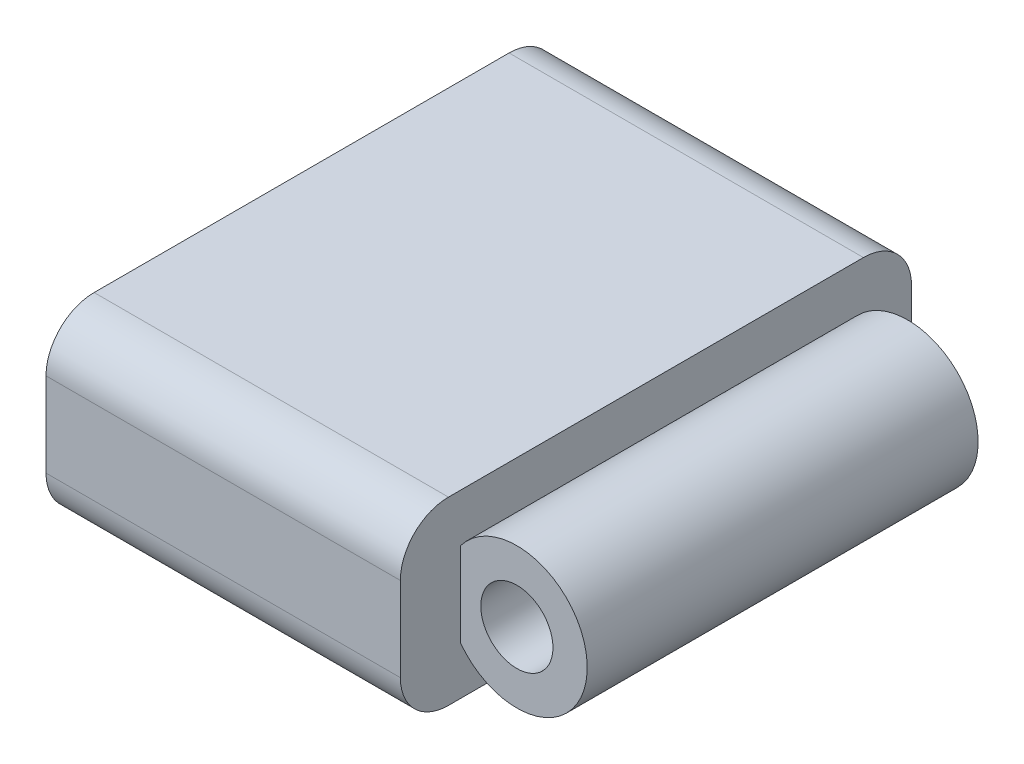
ISO-10303-21;
HEADER;
FILE_DESCRIPTION(('STEP AP214'),'2;1');
FILE_NAME('part.step','',(''),(''),'','','');
FILE_SCHEMA(('AUTOMOTIVE_DESIGN { 1 0 10303 214 1 1 1 1 }'));
ENDSEC;
DATA;
#1=APPLICATION_CONTEXT('core data for automotive mechanical design processes');
#2=APPLICATION_PROTOCOL_DEFINITION('international standard','automotive_design',2000,#1);
#3=PRODUCT_CONTEXT('',#1,'mechanical');
#4=PRODUCT('Part','Part','',(#3));
#5=PRODUCT_RELATED_PRODUCT_CATEGORY('part','',(#4));
#6=PRODUCT_DEFINITION_FORMATION('','',#4);
#7=PRODUCT_DEFINITION_CONTEXT('part definition',#1,'design');
#8=PRODUCT_DEFINITION('design','',#6,#7);
#9=PRODUCT_DEFINITION_SHAPE('','',#8);
#10=(LENGTH_UNIT() NAMED_UNIT(*) SI_UNIT(.MILLI.,.METRE.));
#11=(NAMED_UNIT(*) PLANE_ANGLE_UNIT() SI_UNIT($,.RADIAN.));
#12=(NAMED_UNIT(*) SI_UNIT($,.STERADIAN.) SOLID_ANGLE_UNIT());
#13=UNCERTAINTY_MEASURE_WITH_UNIT(LENGTH_MEASURE(1.E-05),#10,'distance_accuracy_value','');
#14=(GEOMETRIC_REPRESENTATION_CONTEXT(3) GLOBAL_UNCERTAINTY_ASSIGNED_CONTEXT((#13)) GLOBAL_UNIT_ASSIGNED_CONTEXT((#10,
#11,#12)) REPRESENTATION_CONTEXT('',''));
#15=CARTESIAN_POINT('',(0.,0.,0.));
#16=DIRECTION('',(0.,0.,1.));
#17=DIRECTION('',(1.,0.,0.));
#18=AXIS2_PLACEMENT_3D('',#15,#16,#17);
#19=CARTESIAN_POINT('',(0.,19.05,0.));
#20=DIRECTION('',(0.,0.,-1.));
#21=DIRECTION('',(-1.,0.,0.));
#22=AXIS2_PLACEMENT_3D('',#19,#20,#21);
#23=PLANE('',#22);
#24=DIRECTION('',(1.,0.,0.));
#25=VECTOR('',#24,1.);
#26=CARTESIAN_POINT('',(50.8,5.08,0.));
#27=LINE('',#26,#25);
#28=CARTESIAN_POINT('',(0.,5.08,0.));
#29=VERTEX_POINT('',#28);
#30=CARTESIAN_POINT('',(37.4173961667043,5.08,0.));
#31=VERTEX_POINT('',#30);
#32=EDGE_CURVE('E252',#29,#31,#27,.T.);
#33=ORIENTED_EDGE('',*,*,#32,.T.);
#34=DIRECTION('',(0.,1.,0.));
#35=VECTOR('',#34,1.);
#36=CARTESIAN_POINT('',(37.4173961667043,0.,0.));
#37=LINE('',#36,#35);
#38=CARTESIAN_POINT('',(37.4173961667043,13.97,0.));
#39=VERTEX_POINT('',#38);
#40=EDGE_CURVE('E374',#31,#39,#37,.T.);
#41=ORIENTED_EDGE('',*,*,#40,.T.);
#42=DIRECTION('',(1.,0.,0.));
#43=VECTOR('',#42,1.);
#44=CARTESIAN_POINT('',(0.,13.97,0.));
#45=LINE('',#44,#43);
#46=CARTESIAN_POINT('',(0.,13.97,0.));
#47=VERTEX_POINT('',#46);
#48=EDGE_CURVE('E249',#39,#47,#45,.F.);
#49=ORIENTED_EDGE('',*,*,#48,.T.);
#50=DIRECTION('',(0.,-1.,0.));
#51=VECTOR('',#50,1.);
#52=CARTESIAN_POINT('',(0.,19.05,0.));
#53=LINE('',#52,#51);
#54=EDGE_CURVE('E219',#47,#29,#53,.T.);
#55=ORIENTED_EDGE('',*,*,#54,.T.);
#56=EDGE_LOOP('',(#33,#41,#49,#55));
#57=FACE_BOUND('',#56,.T.);
#58=ADVANCED_FACE('F39',(#57),#23,.F.);
#59=CARTESIAN_POINT('',(0.,19.05,-53.975));
#60=DIRECTION('',(0.,0.,1.));
#61=DIRECTION('',(1.,0.,0.));
#62=AXIS2_PLACEMENT_3D('',#59,#60,#61);
#63=PLANE('',#62);
#64=DIRECTION('',(-1.,0.,0.));
#65=VECTOR('',#64,1.);
#66=CARTESIAN_POINT('',(0.,13.97,-53.975));
#67=LINE('',#66,#65);
#68=CARTESIAN_POINT('',(0.,13.97,-53.975));
#69=VERTEX_POINT('',#68);
#70=CARTESIAN_POINT('',(37.4173961667043,13.97,-53.975));
#71=VERTEX_POINT('',#70);
#72=EDGE_CURVE('E223',#69,#71,#67,.F.);
#73=ORIENTED_EDGE('',*,*,#72,.T.);
#74=DIRECTION('',(0.,1.,0.));
#75=VECTOR('',#74,1.);
#76=CARTESIAN_POINT('',(37.4173961667043,0.,-53.975));
#77=LINE('',#76,#75);
#78=CARTESIAN_POINT('',(37.4173961667043,5.08,-53.975));
#79=VERTEX_POINT('',#78);
#80=EDGE_CURVE('E182',#79,#71,#77,.T.);
#81=ORIENTED_EDGE('',*,*,#80,.F.);
#82=DIRECTION('',(-1.,0.,0.));
#83=VECTOR('',#82,1.);
#84=CARTESIAN_POINT('',(0.,5.08,-53.975));
#85=LINE('',#84,#83);
#86=CARTESIAN_POINT('',(0.,5.08,-53.975));
#87=VERTEX_POINT('',#86);
#88=EDGE_CURVE('E227',#79,#87,#85,.T.);
#89=ORIENTED_EDGE('',*,*,#88,.T.);
#90=DIRECTION('',(0.,-1.,0.));
#91=VECTOR('',#90,1.);
#92=CARTESIAN_POINT('',(0.,19.05,-53.975));
#93=LINE('',#92,#91);
#94=EDGE_CURVE('E212',#69,#87,#93,.T.);
#95=ORIENTED_EDGE('',*,*,#94,.F.);
#96=EDGE_LOOP('',(#73,#81,#89,#95));
#97=FACE_BOUND('',#96,.T.);
#98=ADVANCED_FACE('F390',(#97),#63,.F.);
#99=CARTESIAN_POINT('',(0.,19.05,0.));
#100=DIRECTION('',(1.,0.,0.));
#101=DIRECTION('',(0.,0.,-1.));
#102=AXIS2_PLACEMENT_3D('',#99,#100,#101);
#103=PLANE('',#102);
#104=DIRECTION('',(0.,0.,1.));
#105=VECTOR('',#104,1.);
#106=CARTESIAN_POINT('',(0.,1.90500000000001,-6.66749999999999));
#107=LINE('',#106,#105);
#108=CARTESIAN_POINT('',(0.,1.905,-44.7675));
#109=VERTEX_POINT('',#108);
#110=CARTESIAN_POINT('',(0.,1.90500000000001,-9.20749999999999));
#111=VERTEX_POINT('',#110);
#112=EDGE_CURVE('E320',#109,#111,#107,.T.);
#113=ORIENTED_EDGE('',*,*,#112,.F.);
#114=CARTESIAN_POINT('',(0.,4.44500000000001,-44.7675));
#115=DIRECTION('',(1.,0.,0.));
#116=DIRECTION('',(0.,0.,-1.));
#117=AXIS2_PLACEMENT_3D('',#114,#115,#116);
#118=CIRCLE('',#117,2.54);
#119=CARTESIAN_POINT('',(0.,4.44500000000001,-47.3075));
#120=VERTEX_POINT('',#119);
#121=EDGE_CURVE('E48',#109,#120,#118,.T.);
#122=ORIENTED_EDGE('',*,*,#121,.T.);
#123=DIRECTION('',(0.,-1.,0.));
#124=VECTOR('',#123,1.);
#125=CARTESIAN_POINT('',(0.,1.905,-47.3075));
#126=LINE('',#125,#124);
#127=CARTESIAN_POINT('',(0.,14.605,-47.3075));
#128=VERTEX_POINT('',#127);
#129=EDGE_CURVE('E332',#128,#120,#126,.T.);
#130=ORIENTED_EDGE('',*,*,#129,.F.);
#131=CARTESIAN_POINT('',(0.,14.605,-44.7675));
#132=DIRECTION('',(1.,0.,0.));
#133=DIRECTION('',(0.,0.,-1.));
#134=AXIS2_PLACEMENT_3D('',#131,#132,#133);
#135=CIRCLE('',#134,2.54);
#136=CARTESIAN_POINT('',(0.,17.145,-44.7675));
#137=VERTEX_POINT('',#136);
#138=EDGE_CURVE('E11',#128,#137,#135,.T.);
#139=ORIENTED_EDGE('',*,*,#138,.T.);
#140=DIRECTION('',(0.,0.,-1.));
#141=VECTOR('',#140,1.);
#142=CARTESIAN_POINT('',(0.,17.145,-6.66749999999999));
#143=LINE('',#142,#141);
#144=CARTESIAN_POINT('',(0.,17.145,-9.20749999999999));
#145=VERTEX_POINT('',#144);
#146=EDGE_CURVE('E362',#145,#137,#143,.T.);
#147=ORIENTED_EDGE('',*,*,#146,.F.);
#148=CARTESIAN_POINT('',(0.,14.605,-9.20749999999999));
#149=DIRECTION('',(1.,0.,0.));
#150=DIRECTION('',(0.,0.,-1.));
#151=AXIS2_PLACEMENT_3D('',#148,#149,#150);
#152=CIRCLE('',#151,2.54);
#153=CARTESIAN_POINT('',(0.,14.605,-6.66749999999999));
#154=VERTEX_POINT('',#153);
#155=EDGE_CURVE('E310',#145,#154,#152,.T.);
#156=ORIENTED_EDGE('',*,*,#155,.T.);
#157=DIRECTION('',(0.,1.,0.));
#158=VECTOR('',#157,1.);
#159=CARTESIAN_POINT('',(0.,1.90500000000001,-6.66749999999999));
#160=LINE('',#159,#158);
#161=CARTESIAN_POINT('',(0.,4.44500000000001,-6.66749999999999));
#162=VERTEX_POINT('',#161);
#163=EDGE_CURVE('E322',#162,#154,#160,.T.);
#164=ORIENTED_EDGE('',*,*,#163,.F.);
#165=CARTESIAN_POINT('',(0.,4.44500000000001,-9.20749999999999));
#166=DIRECTION('',(1.,0.,0.));
#167=DIRECTION('',(0.,0.,-1.));
#168=AXIS2_PLACEMENT_3D('',#165,#166,#167);
#169=CIRCLE('',#168,2.54);
#170=EDGE_CURVE('E313',#162,#111,#169,.T.);
#171=ORIENTED_EDGE('',*,*,#170,.T.);
#172=EDGE_LOOP('',(#113,#122,#130,#139,#147,#156,#164,#171));
#173=FACE_BOUND('',#172,.T.);
#174=ORIENTED_EDGE('',*,*,#94,.T.);
#175=CARTESIAN_POINT('',(0.,5.08,-48.895));
#176=DIRECTION('',(1.,0.,0.));
#177=DIRECTION('',(0.,0.,-1.));
#178=AXIS2_PLACEMENT_3D('',#175,#176,#177);
#179=CIRCLE('',#178,5.08);
#180=CARTESIAN_POINT('',(0.,0.,-48.895));
#181=VERTEX_POINT('',#180);
#182=EDGE_CURVE('E239',#87,#181,#179,.F.);
#183=ORIENTED_EDGE('',*,*,#182,.T.);
#184=DIRECTION('',(0.,0.,1.));
#185=VECTOR('',#184,1.);
#186=CARTESIAN_POINT('',(0.,0.,0.));
#187=LINE('',#186,#185);
#188=CARTESIAN_POINT('',(0.,0.,-5.08));
#189=VERTEX_POINT('',#188);
#190=EDGE_CURVE('E207',#181,#189,#187,.T.);
#191=ORIENTED_EDGE('',*,*,#190,.T.);
#192=CARTESIAN_POINT('',(0.,5.08,-5.08));
#193=DIRECTION('',(1.,0.,0.));
#194=DIRECTION('',(0.,0.,-1.));
#195=AXIS2_PLACEMENT_3D('',#192,#193,#194);
#196=CIRCLE('',#195,5.08);
#197=EDGE_CURVE('E236',#189,#29,#196,.F.);
#198=ORIENTED_EDGE('',*,*,#197,.T.);
#199=ORIENTED_EDGE('',*,*,#54,.F.);
#200=CARTESIAN_POINT('',(0.,13.97,-5.08));
#201=DIRECTION('',(1.,0.,0.));
#202=DIRECTION('',(0.,0.,-1.));
#203=AXIS2_PLACEMENT_3D('',#200,#201,#202);
#204=CIRCLE('',#203,5.08);
#205=CARTESIAN_POINT('',(0.,19.05,-5.08));
#206=VERTEX_POINT('',#205);
#207=EDGE_CURVE('E230',#47,#206,#204,.F.);
#208=ORIENTED_EDGE('',*,*,#207,.T.);
#209=DIRECTION('',(0.,0.,1.));
#210=VECTOR('',#209,1.);
#211=CARTESIAN_POINT('',(0.,19.05,0.));
#212=LINE('',#211,#210);
#213=CARTESIAN_POINT('',(0.,19.05,-48.895));
#214=VERTEX_POINT('',#213);
#215=EDGE_CURVE('E208',#214,#206,#212,.T.);
#216=ORIENTED_EDGE('',*,*,#215,.F.);
#217=CARTESIAN_POINT('',(0.,13.97,-48.895));
#218=DIRECTION('',(1.,0.,0.));
#219=DIRECTION('',(0.,0.,-1.));
#220=AXIS2_PLACEMENT_3D('',#217,#218,#219);
#221=CIRCLE('',#220,5.08);
#222=EDGE_CURVE('E233',#214,#69,#221,.F.);
#223=ORIENTED_EDGE('',*,*,#222,.T.);
#224=EDGE_LOOP('',(#174,#183,#191,#198,#199,#208,#216,#223));
#225=FACE_BOUND('',#224,.T.);
#226=ADVANCED_FACE('F318',(#173,#225),#103,.F.);
#227=CARTESIAN_POINT('',(0.,19.05,0.));
#228=DIRECTION('',(0.,-1.,0.));
#229=DIRECTION('',(0.,0.,-1.));
#230=AXIS2_PLACEMENT_3D('',#227,#228,#229);
#231=PLANE('',#230);
#232=DIRECTION('',(1.,0.,0.));
#233=VECTOR('',#232,1.);
#234=CARTESIAN_POINT('',(0.,19.05,-5.08));
#235=LINE('',#234,#233);
#236=CARTESIAN_POINT('',(37.4173961667043,19.05,-5.08));
#237=VERTEX_POINT('',#236);
#238=EDGE_CURVE('E256',#206,#237,#235,.T.);
#239=ORIENTED_EDGE('',*,*,#238,.T.);
#240=DIRECTION('',(0.,0.,1.));
#241=VECTOR('',#240,1.);
#242=CARTESIAN_POINT('',(37.4173961667043,19.05,-53.975));
#243=LINE('',#242,#241);
#244=CARTESIAN_POINT('',(37.4173961667043,19.05,-48.895));
#245=VERTEX_POINT('',#244);
#246=EDGE_CURVE('E199',#245,#237,#243,.T.);
#247=ORIENTED_EDGE('',*,*,#246,.F.);
#248=DIRECTION('',(-1.,0.,0.));
#249=VECTOR('',#248,1.);
#250=CARTESIAN_POINT('',(0.,19.05,-48.895));
#251=LINE('',#250,#249);
#252=EDGE_CURVE('E260',#245,#214,#251,.T.);
#253=ORIENTED_EDGE('',*,*,#252,.T.);
#254=ORIENTED_EDGE('',*,*,#215,.T.);
#255=EDGE_LOOP('',(#239,#247,#253,#254));
#256=FACE_BOUND('',#255,.T.);
#257=ADVANCED_FACE('F398',(#256),#231,.F.);
#258=CARTESIAN_POINT('',(0.,0.,0.));
#259=DIRECTION('',(0.,-1.,0.));
#260=DIRECTION('',(0.,0.,-1.));
#261=AXIS2_PLACEMENT_3D('',#258,#259,#260);
#262=PLANE('',#261);
#263=DIRECTION('',(0.,0.,1.));
#264=VECTOR('',#263,1.);
#265=CARTESIAN_POINT('',(37.4173961667043,0.,-53.975));
#266=LINE('',#265,#264);
#267=CARTESIAN_POINT('',(37.4173961667043,0.,-48.895));
#268=VERTEX_POINT('',#267);
#269=CARTESIAN_POINT('',(37.4173961667043,0.,-5.08));
#270=VERTEX_POINT('',#269);
#271=EDGE_CURVE('E188',#268,#270,#266,.T.);
#272=ORIENTED_EDGE('',*,*,#271,.T.);
#273=DIRECTION('',(1.,0.,0.));
#274=VECTOR('',#273,1.);
#275=CARTESIAN_POINT('',(0.,0.,-5.08));
#276=LINE('',#275,#274);
#277=EDGE_CURVE('E242',#270,#189,#276,.F.);
#278=ORIENTED_EDGE('',*,*,#277,.T.);
#279=ORIENTED_EDGE('',*,*,#190,.F.);
#280=DIRECTION('',(-1.,0.,0.));
#281=VECTOR('',#280,1.);
#282=CARTESIAN_POINT('',(50.8,0.,-48.895));
#283=LINE('',#282,#281);
#284=EDGE_CURVE('E245',#181,#268,#283,.F.);
#285=ORIENTED_EDGE('',*,*,#284,.T.);
#286=EDGE_LOOP('',(#272,#278,#279,#285));
#287=FACE_BOUND('',#286,.T.);
#288=ADVANCED_FACE('F412',(#287),#262,.T.);
#289=CARTESIAN_POINT('',(0.,5.08,-48.895));
#290=DIRECTION('',(1.,0.,0.));
#291=DIRECTION('',(0.,0.,-1.));
#292=AXIS2_PLACEMENT_3D('',#289,#290,#291);
#293=CYLINDRICAL_SURFACE('',#292,5.08);
#294=CARTESIAN_POINT('',(37.4173961667043,5.08,-48.895));
#295=DIRECTION('',(-1.,0.,0.));
#296=DIRECTION('',(0.,0.,1.));
#297=AXIS2_PLACEMENT_3D('',#294,#295,#296);
#298=CIRCLE('',#297,5.08);
#299=EDGE_CURVE('E192',#268,#79,#298,.F.);
#300=ORIENTED_EDGE('',*,*,#299,.F.);
#301=ORIENTED_EDGE('',*,*,#284,.F.);
#302=ORIENTED_EDGE('',*,*,#182,.F.);
#303=ORIENTED_EDGE('',*,*,#88,.F.);
#304=EDGE_LOOP('',(#300,#301,#302,#303));
#305=FACE_BOUND('',#304,.T.);
#306=ADVANCED_FACE('F414',(#305),#293,.T.);
#307=CARTESIAN_POINT('',(0.,5.08,-5.08));
#308=DIRECTION('',(-1.,0.,0.));
#309=DIRECTION('',(0.,0.,1.));
#310=AXIS2_PLACEMENT_3D('',#307,#308,#309);
#311=CYLINDRICAL_SURFACE('',#310,5.08);
#312=CARTESIAN_POINT('',(37.4173961667043,5.08,-5.08));
#313=DIRECTION('',(-1.,0.,0.));
#314=DIRECTION('',(0.,0.,1.));
#315=AXIS2_PLACEMENT_3D('',#312,#313,#314);
#316=CIRCLE('',#315,5.08);
#317=EDGE_CURVE('E267',#31,#270,#316,.F.);
#318=ORIENTED_EDGE('',*,*,#317,.F.);
#319=ORIENTED_EDGE('',*,*,#32,.F.);
#320=ORIENTED_EDGE('',*,*,#197,.F.);
#321=ORIENTED_EDGE('',*,*,#277,.F.);
#322=EDGE_LOOP('',(#318,#319,#320,#321));
#323=FACE_BOUND('',#322,.T.);
#324=ADVANCED_FACE('F408',(#323),#311,.T.);
#325=CARTESIAN_POINT('',(0.,13.97,-48.895));
#326=DIRECTION('',(-1.,0.,0.));
#327=DIRECTION('',(0.,0.,1.));
#328=AXIS2_PLACEMENT_3D('',#325,#326,#327);
#329=CYLINDRICAL_SURFACE('',#328,5.08);
#330=CARTESIAN_POINT('',(37.4173961667043,13.97,-48.895));
#331=DIRECTION('',(-1.,0.,0.));
#332=DIRECTION('',(0.,0.,1.));
#333=AXIS2_PLACEMENT_3D('',#330,#331,#332);
#334=CIRCLE('',#333,5.08);
#335=EDGE_CURVE('E202',#71,#245,#334,.F.);
#336=ORIENTED_EDGE('',*,*,#335,.F.);
#337=ORIENTED_EDGE('',*,*,#72,.F.);
#338=ORIENTED_EDGE('',*,*,#222,.F.);
#339=ORIENTED_EDGE('',*,*,#252,.F.);
#340=EDGE_LOOP('',(#336,#337,#338,#339));
#341=FACE_BOUND('',#340,.T.);
#342=ADVANCED_FACE('F387',(#341),#329,.T.);
#343=CARTESIAN_POINT('',(0.,13.97,-5.08));
#344=DIRECTION('',(1.,0.,0.));
#345=DIRECTION('',(0.,0.,-1.));
#346=AXIS2_PLACEMENT_3D('',#343,#344,#345);
#347=CYLINDRICAL_SURFACE('',#346,5.08);
#348=CARTESIAN_POINT('',(37.4173961667043,13.97,-5.08));
#349=DIRECTION('',(-1.,0.,0.));
#350=DIRECTION('',(0.,0.,1.));
#351=AXIS2_PLACEMENT_3D('',#348,#349,#350);
#352=CIRCLE('',#351,5.08);
#353=EDGE_CURVE('E263',#237,#39,#352,.F.);
#354=ORIENTED_EDGE('',*,*,#353,.F.);
#355=ORIENTED_EDGE('',*,*,#238,.F.);
#356=ORIENTED_EDGE('',*,*,#207,.F.);
#357=ORIENTED_EDGE('',*,*,#48,.F.);
#358=EDGE_LOOP('',(#354,#355,#356,#357));
#359=FACE_BOUND('',#358,.T.);
#360=ADVANCED_FACE('F401',(#359),#347,.T.);
#361=CARTESIAN_POINT('',(43.3705,9.525,-53.975));
#362=DIRECTION('',(0.,0.,1.));
#363=DIRECTION('',(1.,0.,0.));
#364=AXIS2_PLACEMENT_3D('',#361,#362,#363);
#365=CYLINDRICAL_SURFACE('',#364,7.4295);
#366=CARTESIAN_POINT('',(43.3705,9.525,-6.35));
#367=DIRECTION('',(0.,0.,-1.));
#368=DIRECTION('',(-1.,0.,0.));
#369=AXIS2_PLACEMENT_3D('',#366,#367,#368);
#370=CIRCLE('',#369,7.4295);
#371=CARTESIAN_POINT('',(37.4173961667043,5.08,-6.35));
#372=VERTEX_POINT('',#371);
#373=CARTESIAN_POINT('',(37.4173961667043,13.97,-6.35));
#374=VERTEX_POINT('',#373);
#375=EDGE_CURVE('E172',#372,#374,#370,.F.);
#376=ORIENTED_EDGE('',*,*,#375,.F.);
#377=DIRECTION('',(0.,0.,1.));
#378=VECTOR('',#377,1.);
#379=CARTESIAN_POINT('',(37.4173961667043,5.08,-53.975));
#380=LINE('',#379,#378);
#381=CARTESIAN_POINT('',(37.4173961667043,5.08,-47.625));
#382=VERTEX_POINT('',#381);
#383=EDGE_CURVE('E179',#382,#372,#380,.T.);
#384=ORIENTED_EDGE('',*,*,#383,.F.);
#385=CARTESIAN_POINT('',(43.3705,9.525,-47.625));
#386=DIRECTION('',(0.,0.,1.));
#387=DIRECTION('',(1.,0.,0.));
#388=AXIS2_PLACEMENT_3D('',#385,#386,#387);
#389=CIRCLE('',#388,7.4295);
#390=CARTESIAN_POINT('',(37.4173961667043,13.97,-47.625));
#391=VERTEX_POINT('',#390);
#392=EDGE_CURVE('E163',#391,#382,#389,.F.);
#393=ORIENTED_EDGE('',*,*,#392,.F.);
#394=DIRECTION('',(0.,0.,1.));
#395=VECTOR('',#394,1.);
#396=CARTESIAN_POINT('',(37.4173961667043,13.97,-53.975));
#397=LINE('',#396,#395);
#398=EDGE_CURVE('E180',#391,#374,#397,.T.);
#399=ORIENTED_EDGE('',*,*,#398,.T.);
#400=EDGE_LOOP('',(#376,#384,#393,#399));
#401=FACE_BOUND('',#400,.T.);
#402=ADVANCED_FACE('F186',(#401),#365,.T.);
#403=CARTESIAN_POINT('',(37.4173961667043,0.,-53.975));
#404=DIRECTION('',(-1.,0.,0.));
#405=DIRECTION('',(0.,0.,1.));
#406=AXIS2_PLACEMENT_3D('',#403,#404,#405);
#407=PLANE('',#406);
#408=ORIENTED_EDGE('',*,*,#40,.F.);
#409=ORIENTED_EDGE('',*,*,#317,.T.);
#410=ORIENTED_EDGE('',*,*,#271,.F.);
#411=ORIENTED_EDGE('',*,*,#299,.T.);
#412=ORIENTED_EDGE('',*,*,#80,.T.);
#413=ORIENTED_EDGE('',*,*,#335,.T.);
#414=ORIENTED_EDGE('',*,*,#246,.T.);
#415=ORIENTED_EDGE('',*,*,#353,.T.);
#416=EDGE_LOOP('',(#408,#409,#410,#411,#412,#413,#414,#415));
#417=FACE_BOUND('',#416,.T.);
#418=ORIENTED_EDGE('',*,*,#383,.T.);
#419=DIRECTION('',(0.,1.,0.));
#420=VECTOR('',#419,1.);
#421=CARTESIAN_POINT('',(37.4173961667043,0.,-6.35));
#422=LINE('',#421,#420);
#423=EDGE_CURVE('E173',#372,#374,#422,.T.);
#424=ORIENTED_EDGE('',*,*,#423,.T.);
#425=ORIENTED_EDGE('',*,*,#398,.F.);
#426=DIRECTION('',(0.,1.,0.));
#427=VECTOR('',#426,1.);
#428=CARTESIAN_POINT('',(37.4173961667043,0.,-47.625));
#429=LINE('',#428,#427);
#430=EDGE_CURVE('E166',#382,#391,#429,.T.);
#431=ORIENTED_EDGE('',*,*,#430,.F.);
#432=EDGE_LOOP('',(#418,#424,#425,#431));
#433=FACE_BOUND('',#432,.T.);
#434=ADVANCED_FACE('F177',(#417,#433),#407,.F.);
#435=CARTESIAN_POINT('',(37.4173961667043,0.,-47.625));
#436=DIRECTION('',(0.,0.,1.));
#437=DIRECTION('',(1.,0.,0.));
#438=AXIS2_PLACEMENT_3D('',#435,#436,#437);
#439=PLANE('',#438);
#440=CARTESIAN_POINT('',(43.3705,9.525,-47.625));
#441=DIRECTION('',(0.,0.,1.));
#442=DIRECTION('',(1.,0.,0.));
#443=AXIS2_PLACEMENT_3D('',#440,#441,#442);
#444=CIRCLE('',#443,3.81);
#445=CARTESIAN_POINT('',(47.1805,9.525,-47.625));
#446=VERTEX_POINT('',#445);
#447=EDGE_CURVE('E183',#446,#446,#444,.T.);
#448=ORIENTED_EDGE('',*,*,#447,.T.);
#449=EDGE_LOOP('',(#448));
#450=FACE_BOUND('',#449,.T.);
#451=ORIENTED_EDGE('',*,*,#392,.T.);
#452=ORIENTED_EDGE('',*,*,#430,.T.);
#453=EDGE_LOOP('',(#451,#452));
#454=FACE_BOUND('',#453,.T.);
#455=ADVANCED_FACE('F165',(#450,#454),#439,.F.);
#456=CARTESIAN_POINT('',(37.4173961667043,0.,-6.35));
#457=DIRECTION('',(0.,0.,-1.));
#458=DIRECTION('',(-1.,0.,0.));
#459=AXIS2_PLACEMENT_3D('',#456,#457,#458);
#460=PLANE('',#459);
#461=CARTESIAN_POINT('',(43.3705,9.525,-6.35));
#462=DIRECTION('',(0.,0.,1.));
#463=DIRECTION('',(1.,0.,0.));
#464=AXIS2_PLACEMENT_3D('',#461,#462,#463);
#465=CIRCLE('',#464,3.81);
#466=CARTESIAN_POINT('',(47.1805,9.525,-6.35));
#467=VERTEX_POINT('',#466);
#468=EDGE_CURVE('E352',#467,#467,#465,.T.);
#469=ORIENTED_EDGE('',*,*,#468,.F.);
#470=EDGE_LOOP('',(#469));
#471=FACE_BOUND('',#470,.T.);
#472=ORIENTED_EDGE('',*,*,#375,.T.);
#473=ORIENTED_EDGE('',*,*,#423,.F.);
#474=EDGE_LOOP('',(#472,#473));
#475=FACE_BOUND('',#474,.T.);
#476=ADVANCED_FACE('F444',(#471,#475),#460,.F.);
#477=CARTESIAN_POINT('',(43.3705,9.525,-53.975));
#478=DIRECTION('',(0.,0.,1.));
#479=DIRECTION('',(1.,0.,0.));
#480=AXIS2_PLACEMENT_3D('',#477,#478,#479);
#481=CYLINDRICAL_SURFACE('',#480,3.81);
#482=ORIENTED_EDGE('',*,*,#468,.T.);
#483=EDGE_LOOP('',(#482));
#484=FACE_BOUND('',#483,.T.);
#485=ORIENTED_EDGE('',*,*,#447,.F.);
#486=EDGE_LOOP('',(#485));
#487=FACE_BOUND('',#486,.T.);
#488=ADVANCED_FACE('F448',(#484,#487),#481,.F.);
#489=CARTESIAN_POINT('',(17.78,1.905,-47.3075));
#490=DIRECTION('',(0.,0.,-1.));
#491=DIRECTION('',(-1.,0.,0.));
#492=AXIS2_PLACEMENT_3D('',#489,#490,#491);
#493=PLANE('',#492);
#494=ORIENTED_EDGE('',*,*,#129,.T.);
#495=DIRECTION('',(-1.,0.,0.));
#496=VECTOR('',#495,1.);
#497=CARTESIAN_POINT('',(17.78,4.44500000000001,-47.3075));
#498=LINE('',#497,#496);
#499=CARTESIAN_POINT('',(17.78,4.44500000000001,-47.3075));
#500=VERTEX_POINT('',#499);
#501=EDGE_CURVE('E307',#120,#500,#498,.F.);
#502=ORIENTED_EDGE('',*,*,#501,.T.);
#503=DIRECTION('',(0.,-1.,0.));
#504=VECTOR('',#503,1.);
#505=CARTESIAN_POINT('',(17.78,1.905,-47.3075));
#506=LINE('',#505,#504);
#507=CARTESIAN_POINT('',(17.78,14.605,-47.3075));
#508=VERTEX_POINT('',#507);
#509=EDGE_CURVE('E354',#508,#500,#506,.T.);
#510=ORIENTED_EDGE('',*,*,#509,.F.);
#511=DIRECTION('',(-1.,0.,0.));
#512=VECTOR('',#511,1.);
#513=CARTESIAN_POINT('',(0.,14.605,-47.3075));
#514=LINE('',#513,#512);
#515=EDGE_CURVE('E304',#508,#128,#514,.T.);
#516=ORIENTED_EDGE('',*,*,#515,.T.);
#517=EDGE_LOOP('',(#494,#502,#510,#516));
#518=FACE_BOUND('',#517,.T.);
#519=ADVANCED_FACE('F452',(#518),#493,.F.);
#520=CARTESIAN_POINT('',(17.78,17.145,-6.66749999999999));
#521=DIRECTION('',(0.,1.,0.));
#522=DIRECTION('',(0.,0.,1.));
#523=AXIS2_PLACEMENT_3D('',#520,#521,#522);
#524=PLANE('',#523);
#525=DIRECTION('',(0.,0.,-1.));
#526=VECTOR('',#525,1.);
#527=CARTESIAN_POINT('',(17.78,17.145,-6.66749999999999));
#528=LINE('',#527,#526);
#529=CARTESIAN_POINT('',(17.78,17.145,-9.20749999999999));
#530=VERTEX_POINT('',#529);
#531=CARTESIAN_POINT('',(17.78,17.145,-44.7675));
#532=VERTEX_POINT('',#531);
#533=EDGE_CURVE('E347',#530,#532,#528,.T.);
#534=ORIENTED_EDGE('',*,*,#533,.F.);
#535=DIRECTION('',(-1.,0.,0.));
#536=VECTOR('',#535,1.);
#537=CARTESIAN_POINT('',(0.,17.145,-9.20749999999999));
#538=LINE('',#537,#536);
#539=EDGE_CURVE('E274',#530,#145,#538,.T.);
#540=ORIENTED_EDGE('',*,*,#539,.T.);
#541=ORIENTED_EDGE('',*,*,#146,.T.);
#542=DIRECTION('',(-1.,0.,0.));
#543=VECTOR('',#542,1.);
#544=CARTESIAN_POINT('',(17.78,17.145,-44.7675));
#545=LINE('',#544,#543);
#546=EDGE_CURVE('E271',#137,#532,#545,.F.);
#547=ORIENTED_EDGE('',*,*,#546,.T.);
#548=EDGE_LOOP('',(#534,#540,#541,#547));
#549=FACE_BOUND('',#548,.T.);
#550=ADVANCED_FACE('F456',(#549),#524,.F.);
#551=CARTESIAN_POINT('',(17.78,1.90500000000001,-6.66749999999999));
#552=DIRECTION('',(0.,0.,1.));
#553=DIRECTION('',(1.,0.,0.));
#554=AXIS2_PLACEMENT_3D('',#551,#552,#553);
#555=PLANE('',#554);
#556=ORIENTED_EDGE('',*,*,#163,.T.);
#557=DIRECTION('',(-1.,0.,0.));
#558=VECTOR('',#557,1.);
#559=CARTESIAN_POINT('',(17.78,14.605,-6.66749999999999));
#560=LINE('',#559,#558);
#561=CARTESIAN_POINT('',(17.78,14.605,-6.66749999999999));
#562=VERTEX_POINT('',#561);
#563=EDGE_CURVE('E282',#154,#562,#560,.F.);
#564=ORIENTED_EDGE('',*,*,#563,.T.);
#565=DIRECTION('',(0.,1.,0.));
#566=VECTOR('',#565,1.);
#567=CARTESIAN_POINT('',(17.78,1.90500000000001,-6.66749999999999));
#568=LINE('',#567,#566);
#569=CARTESIAN_POINT('',(17.78,4.44500000000001,-6.66749999999999));
#570=VERTEX_POINT('',#569);
#571=EDGE_CURVE('E340',#570,#562,#568,.T.);
#572=ORIENTED_EDGE('',*,*,#571,.F.);
#573=DIRECTION('',(-1.,0.,0.));
#574=VECTOR('',#573,1.);
#575=CARTESIAN_POINT('',(0.,4.44500000000001,-6.66749999999999));
#576=LINE('',#575,#574);
#577=EDGE_CURVE('E278',#570,#162,#576,.T.);
#578=ORIENTED_EDGE('',*,*,#577,.T.);
#579=EDGE_LOOP('',(#556,#564,#572,#578));
#580=FACE_BOUND('',#579,.T.);
#581=ADVANCED_FACE('F344',(#580),#555,.F.);
#582=CARTESIAN_POINT('',(17.78,1.90500000000001,-6.66749999999999));
#583=DIRECTION('',(0.,-1.,0.));
#584=DIRECTION('',(0.,0.,-1.));
#585=AXIS2_PLACEMENT_3D('',#582,#583,#584);
#586=PLANE('',#585);
#587=ORIENTED_EDGE('',*,*,#112,.T.);
#588=DIRECTION('',(-1.,0.,0.));
#589=VECTOR('',#588,1.);
#590=CARTESIAN_POINT('',(17.78,1.90500000000001,-9.20749999999999));
#591=LINE('',#590,#589);
#592=CARTESIAN_POINT('',(17.78,1.90500000000001,-9.20749999999999));
#593=VERTEX_POINT('',#592);
#594=EDGE_CURVE('E301',#111,#593,#591,.F.);
#595=ORIENTED_EDGE('',*,*,#594,.T.);
#596=DIRECTION('',(0.,0.,1.));
#597=VECTOR('',#596,1.);
#598=CARTESIAN_POINT('',(17.78,1.90500000000001,-6.66749999999999));
#599=LINE('',#598,#597);
#600=CARTESIAN_POINT('',(17.78,1.905,-44.7675));
#601=VERTEX_POINT('',#600);
#602=EDGE_CURVE('E342',#601,#593,#599,.T.);
#603=ORIENTED_EDGE('',*,*,#602,.F.);
#604=DIRECTION('',(-1.,0.,0.));
#605=VECTOR('',#604,1.);
#606=CARTESIAN_POINT('',(0.,1.90500000000001,-44.7675));
#607=LINE('',#606,#605);
#608=EDGE_CURVE('E297',#601,#109,#607,.T.);
#609=ORIENTED_EDGE('',*,*,#608,.T.);
#610=EDGE_LOOP('',(#587,#595,#603,#609));
#611=FACE_BOUND('',#610,.T.);
#612=ADVANCED_FACE('F327',(#611),#586,.F.);
#613=CARTESIAN_POINT('',(17.78,0.,0.));
#614=DIRECTION('',(-1.,0.,0.));
#615=DIRECTION('',(0.,0.,1.));
#616=AXIS2_PLACEMENT_3D('',#613,#614,#615);
#617=PLANE('',#616);
#618=ORIENTED_EDGE('',*,*,#571,.T.);
#619=CARTESIAN_POINT('',(17.78,14.605,-9.20749999999999));
#620=DIRECTION('',(-1.,0.,0.));
#621=DIRECTION('',(0.,0.,1.));
#622=AXIS2_PLACEMENT_3D('',#619,#620,#621);
#623=CIRCLE('',#622,2.54);
#624=EDGE_CURVE('E294',#562,#530,#623,.T.);
#625=ORIENTED_EDGE('',*,*,#624,.T.);
#626=ORIENTED_EDGE('',*,*,#533,.T.);
#627=CARTESIAN_POINT('',(17.78,14.605,-44.7675));
#628=DIRECTION('',(-1.,0.,0.));
#629=DIRECTION('',(0.,0.,1.));
#630=AXIS2_PLACEMENT_3D('',#627,#628,#629);
#631=CIRCLE('',#630,2.54);
#632=EDGE_CURVE('E285',#532,#508,#631,.T.);
#633=ORIENTED_EDGE('',*,*,#632,.T.);
#634=ORIENTED_EDGE('',*,*,#509,.T.);
#635=CARTESIAN_POINT('',(17.78,4.44500000000001,-44.7675));
#636=DIRECTION('',(-1.,0.,0.));
#637=DIRECTION('',(0.,0.,1.));
#638=AXIS2_PLACEMENT_3D('',#635,#636,#637);
#639=CIRCLE('',#638,2.54);
#640=EDGE_CURVE('E288',#500,#601,#639,.T.);
#641=ORIENTED_EDGE('',*,*,#640,.T.);
#642=ORIENTED_EDGE('',*,*,#602,.T.);
#643=CARTESIAN_POINT('',(17.78,4.44500000000001,-9.20749999999999));
#644=DIRECTION('',(-1.,0.,0.));
#645=DIRECTION('',(0.,0.,1.));
#646=AXIS2_PLACEMENT_3D('',#643,#644,#645);
#647=CIRCLE('',#646,2.54);
#648=EDGE_CURVE('E291',#593,#570,#647,.T.);
#649=ORIENTED_EDGE('',*,*,#648,.T.);
#650=EDGE_LOOP('',(#618,#625,#626,#633,#634,#641,#642,#649));
#651=FACE_BOUND('',#650,.T.);
#652=ADVANCED_FACE('F339',(#651),#617,.T.);
#653=CARTESIAN_POINT('',(17.78,14.605,-9.20749999999999));
#654=DIRECTION('',(1.,0.,0.));
#655=DIRECTION('',(0.,0.,-1.));
#656=AXIS2_PLACEMENT_3D('',#653,#654,#655);
#657=CYLINDRICAL_SURFACE('',#656,2.54);
#658=ORIENTED_EDGE('',*,*,#624,.F.);
#659=ORIENTED_EDGE('',*,*,#563,.F.);
#660=ORIENTED_EDGE('',*,*,#155,.F.);
#661=ORIENTED_EDGE('',*,*,#539,.F.);
#662=EDGE_LOOP('',(#658,#659,#660,#661));
#663=FACE_BOUND('',#662,.T.);
#664=ADVANCED_FACE('F466',(#663),#657,.F.);
#665=CARTESIAN_POINT('',(17.78,4.44500000000001,-9.20749999999999));
#666=DIRECTION('',(1.,0.,0.));
#667=DIRECTION('',(0.,0.,-1.));
#668=AXIS2_PLACEMENT_3D('',#665,#666,#667);
#669=CYLINDRICAL_SURFACE('',#668,2.54);
#670=ORIENTED_EDGE('',*,*,#648,.F.);
#671=ORIENTED_EDGE('',*,*,#594,.F.);
#672=ORIENTED_EDGE('',*,*,#170,.F.);
#673=ORIENTED_EDGE('',*,*,#577,.F.);
#674=EDGE_LOOP('',(#670,#671,#672,#673));
#675=FACE_BOUND('',#674,.T.);
#676=ADVANCED_FACE('F335',(#675),#669,.F.);
#677=CARTESIAN_POINT('',(17.78,4.44500000000001,-44.7675));
#678=DIRECTION('',(1.,0.,0.));
#679=DIRECTION('',(0.,0.,-1.));
#680=AXIS2_PLACEMENT_3D('',#677,#678,#679);
#681=CYLINDRICAL_SURFACE('',#680,2.54);
#682=ORIENTED_EDGE('',*,*,#640,.F.);
#683=ORIENTED_EDGE('',*,*,#501,.F.);
#684=ORIENTED_EDGE('',*,*,#121,.F.);
#685=ORIENTED_EDGE('',*,*,#608,.F.);
#686=EDGE_LOOP('',(#682,#683,#684,#685));
#687=FACE_BOUND('',#686,.T.);
#688=ADVANCED_FACE('F475',(#687),#681,.F.);
#689=CARTESIAN_POINT('',(17.78,14.605,-44.7675));
#690=DIRECTION('',(1.,0.,0.));
#691=DIRECTION('',(0.,0.,-1.));
#692=AXIS2_PLACEMENT_3D('',#689,#690,#691);
#693=CYLINDRICAL_SURFACE('',#692,2.54);
#694=ORIENTED_EDGE('',*,*,#632,.F.);
#695=ORIENTED_EDGE('',*,*,#546,.F.);
#696=ORIENTED_EDGE('',*,*,#138,.F.);
#697=ORIENTED_EDGE('',*,*,#515,.F.);
#698=EDGE_LOOP('',(#694,#695,#696,#697));
#699=FACE_BOUND('',#698,.T.);
#700=ADVANCED_FACE('F41',(#699),#693,.F.);
#701=CLOSED_SHELL('',(#58,#98,#226,#257,#288,#306,#324,#342,#360,#402,#434,#455,#476,#488,#519,
#550,#581,#612,#652,#664,#676,#688,#700));
#702=MANIFOLD_SOLID_BREP('B2',#701);
#703=ADVANCED_BREP_SHAPE_REPRESENTATION('',(#18,#702),#14);
#704=SHAPE_DEFINITION_REPRESENTATION(#9,#703);
ENDSEC;
END-ISO-10303-21;
